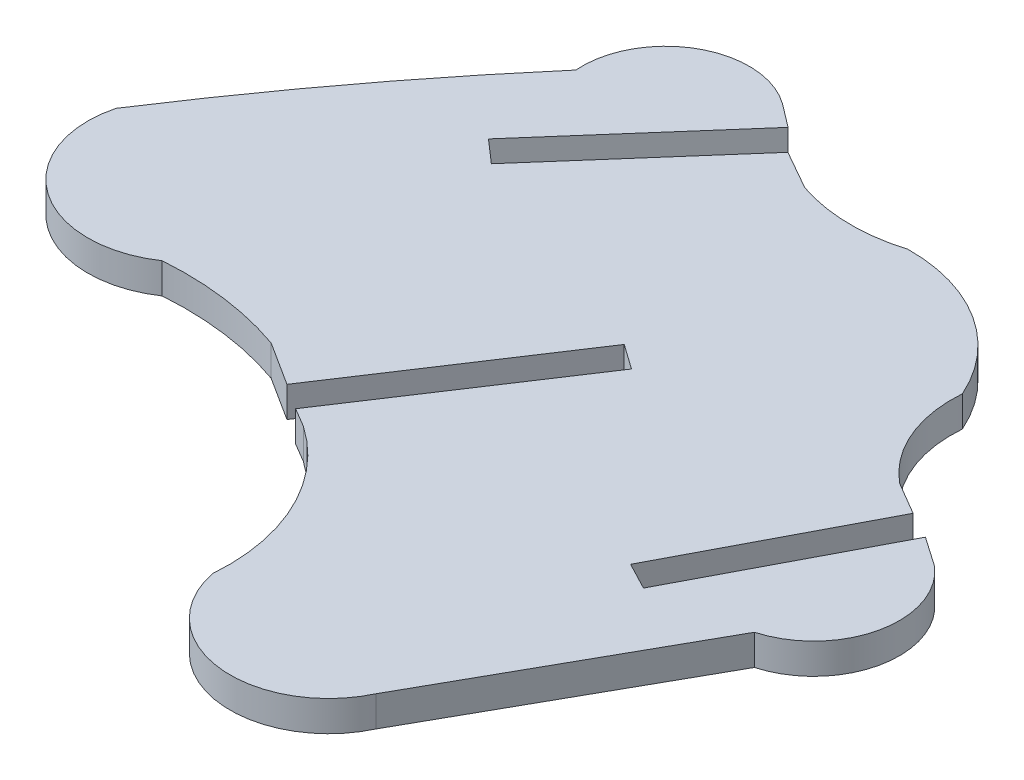
ISO-10303-21;
HEADER;
FILE_DESCRIPTION(('STEP AP214'),'2;1');
FILE_NAME('part.step','',(''),(''),'','','');
FILE_SCHEMA(('AUTOMOTIVE_DESIGN { 1 0 10303 214 1 1 1 1 }'));
ENDSEC;
DATA;
#1=APPLICATION_CONTEXT('core data for automotive mechanical design processes');
#2=APPLICATION_PROTOCOL_DEFINITION('international standard','automotive_design',2000,#1);
#3=PRODUCT_CONTEXT('',#1,'mechanical');
#4=PRODUCT('Part','Part','',(#3));
#5=PRODUCT_RELATED_PRODUCT_CATEGORY('part','',(#4));
#6=PRODUCT_DEFINITION_FORMATION('','',#4);
#7=PRODUCT_DEFINITION_CONTEXT('part definition',#1,'design');
#8=PRODUCT_DEFINITION('design','',#6,#7);
#9=PRODUCT_DEFINITION_SHAPE('','',#8);
#10=(LENGTH_UNIT() NAMED_UNIT(*) SI_UNIT(.MILLI.,.METRE.));
#11=(NAMED_UNIT(*) PLANE_ANGLE_UNIT() SI_UNIT($,.RADIAN.));
#12=(NAMED_UNIT(*) SI_UNIT($,.STERADIAN.) SOLID_ANGLE_UNIT());
#13=UNCERTAINTY_MEASURE_WITH_UNIT(LENGTH_MEASURE(1.E-05),#10,'distance_accuracy_value','');
#14=(GEOMETRIC_REPRESENTATION_CONTEXT(3) GLOBAL_UNCERTAINTY_ASSIGNED_CONTEXT((#13)) GLOBAL_UNIT_ASSIGNED_CONTEXT((#10,
#11,#12)) REPRESENTATION_CONTEXT('',''));
#15=CARTESIAN_POINT('',(0.,0.,0.));
#16=DIRECTION('',(0.,0.,1.));
#17=DIRECTION('',(1.,0.,0.));
#18=AXIS2_PLACEMENT_3D('',#15,#16,#17);
#19=CARTESIAN_POINT('',(-235.711884494084,2.,-510.480569438589));
#20=DIRECTION('',(0.,-1.,0.));
#21=DIRECTION('',(0.,0.,-1.));
#22=AXIS2_PLACEMENT_3D('',#19,#20,#21);
#23=CYLINDRICAL_SURFACE('',#22,12.5412215088);
#24=CARTESIAN_POINT('',(-235.711884494084,0.,-510.480569438589));
#25=DIRECTION('',(0.,1.,0.));
#26=DIRECTION('',(0.,0.,1.));
#27=AXIS2_PLACEMENT_3D('',#24,#25,#26);
#28=CIRCLE('',#27,12.5412215088);
#29=CARTESIAN_POINT('',(-223.211069999984,0.,-509.474650000015));
#30=VERTEX_POINT('',#29);
#31=CARTESIAN_POINT('',(-228.612580000002,0.,-520.818950000026));
#32=VERTEX_POINT('',#31);
#33=EDGE_CURVE('E11',#30,#32,#28,.T.);
#34=ORIENTED_EDGE('',*,*,#33,.F.);
#35=DIRECTION('',(0.,-1.,0.));
#36=VECTOR('',#35,1.);
#37=CARTESIAN_POINT('',(-223.211069999984,2.,-509.474650000015));
#38=LINE('',#37,#36);
#39=CARTESIAN_POINT('',(-223.211069999984,2.,-509.474650000015));
#40=VERTEX_POINT('',#39);
#41=EDGE_CURVE('E56',#40,#30,#38,.T.);
#42=ORIENTED_EDGE('',*,*,#41,.F.);
#43=CARTESIAN_POINT('',(-235.711884494084,2.,-510.480569438589));
#44=DIRECTION('',(0.,1.,0.));
#45=DIRECTION('',(0.,0.,1.));
#46=AXIS2_PLACEMENT_3D('',#43,#44,#45);
#47=CIRCLE('',#46,12.5412215088);
#48=CARTESIAN_POINT('',(-228.612580000002,2.,-520.818950000026));
#49=VERTEX_POINT('',#48);
#50=EDGE_CURVE('E41',#40,#49,#47,.T.);
#51=ORIENTED_EDGE('',*,*,#50,.T.);
#52=DIRECTION('',(0.,-1.,0.));
#53=VECTOR('',#52,1.);
#54=CARTESIAN_POINT('',(-228.612580000002,2.,-520.818950000026));
#55=LINE('',#54,#53);
#56=EDGE_CURVE('E148',#49,#32,#55,.T.);
#57=ORIENTED_EDGE('',*,*,#56,.T.);
#58=EDGE_LOOP('',(#34,#42,#51,#57));
#59=FACE_BOUND('',#58,.T.);
#60=ADVANCED_FACE('F37',(#59),#23,.F.);
#61=CARTESIAN_POINT('',(-216.882166172862,2.,-510.749570742108));
#62=DIRECTION('',(0.,-1.,0.));
#63=DIRECTION('',(0.,0.,-1.));
#64=AXIS2_PLACEMENT_3D('',#61,#62,#63);
#65=CYLINDRICAL_SURFACE('',#64,6.45603954073849);
#66=CARTESIAN_POINT('',(-216.882166172862,0.,-510.749570742108));
#67=DIRECTION('',(0.,1.,0.));
#68=DIRECTION('',(0.,0.,1.));
#69=AXIS2_PLACEMENT_3D('',#66,#67,#68);
#70=CIRCLE('',#69,6.45603954073849);
#71=CARTESIAN_POINT('',(-211.035769999997,0.,-508.010940000024));
#72=VERTEX_POINT('',#71);
#73=EDGE_CURVE('E47',#30,#72,#70,.T.);
#74=ORIENTED_EDGE('',*,*,#73,.T.);
#75=DIRECTION('',(0.,-1.,0.));
#76=VECTOR('',#75,1.);
#77=CARTESIAN_POINT('',(-211.035769999997,2.,-508.010940000024));
#78=LINE('',#77,#76);
#79=CARTESIAN_POINT('',(-211.035769999997,2.,-508.010940000024));
#80=VERTEX_POINT('',#79);
#81=EDGE_CURVE('E229',#80,#72,#78,.T.);
#82=ORIENTED_EDGE('',*,*,#81,.F.);
#83=CARTESIAN_POINT('',(-216.882166172862,2.,-510.749570742108));
#84=DIRECTION('',(0.,1.,0.));
#85=DIRECTION('',(0.,0.,1.));
#86=AXIS2_PLACEMENT_3D('',#83,#84,#85);
#87=CIRCLE('',#86,6.45603954073849);
#88=EDGE_CURVE('E139',#40,#80,#87,.T.);
#89=ORIENTED_EDGE('',*,*,#88,.F.);
#90=ORIENTED_EDGE('',*,*,#41,.T.);
#91=EDGE_LOOP('',(#74,#82,#89,#90));
#92=FACE_BOUND('',#91,.T.);
#93=ADVANCED_FACE('F515',(#92),#65,.T.);
#94=CARTESIAN_POINT('',(-258.966833597603,2.,-422.514085334196));
#95=DIRECTION('',(0.872276162813307,0.,0.48901359468597));
#96=DIRECTION('',(0.48901359468597,0.,-0.872276162813307));
#97=AXIS2_PLACEMENT_3D('',#94,#95,#96);
#98=PLANE('',#97);
#99=DIRECTION('',(-0.48901359468597,0.,0.872276162813307));
#100=VECTOR('',#99,1.);
#101=CARTESIAN_POINT('',(-258.966833597603,0.,-422.514085334196));
#102=LINE('',#101,#100);
#103=CARTESIAN_POINT('',(-202.129890000031,0.,-523.896769999974));
#104=VERTEX_POINT('',#103);
#105=EDGE_CURVE('E234',#104,#72,#102,.T.);
#106=ORIENTED_EDGE('',*,*,#105,.F.);
#107=DIRECTION('',(0.,-1.,0.));
#108=VECTOR('',#107,1.);
#109=CARTESIAN_POINT('',(-202.129890000031,2.,-523.896769999974));
#110=LINE('',#109,#108);
#111=CARTESIAN_POINT('',(-202.129890000031,2.,-523.896769999974));
#112=VERTEX_POINT('',#111);
#113=EDGE_CURVE('E218',#112,#104,#110,.T.);
#114=ORIENTED_EDGE('',*,*,#113,.F.);
#115=DIRECTION('',(-0.48901359468597,0.,0.872276162813307));
#116=VECTOR('',#115,1.);
#117=CARTESIAN_POINT('',(-258.966833597603,2.,-422.514085334196));
#118=LINE('',#117,#116);
#119=EDGE_CURVE('E307',#112,#80,#118,.T.);
#120=ORIENTED_EDGE('',*,*,#119,.T.);
#121=ORIENTED_EDGE('',*,*,#81,.T.);
#122=EDGE_LOOP('',(#106,#114,#120,#121));
#123=FACE_BOUND('',#122,.T.);
#124=ADVANCED_FACE('F239',(#123),#98,.T.);
#125=CARTESIAN_POINT('',(-203.653200815397,2.,-529.303776380724));
#126=DIRECTION('',(0.,-1.,0.));
#127=DIRECTION('',(0.,0.,-1.));
#128=AXIS2_PLACEMENT_3D('',#125,#126,#127);
#129=CYLINDRICAL_SURFACE('',#128,5.61748999479998);
#130=CARTESIAN_POINT('',(-203.653200815397,0.,-529.303776380724));
#131=DIRECTION('',(0.,1.,0.));
#132=DIRECTION('',(0.,0.,1.));
#133=AXIS2_PLACEMENT_3D('',#130,#131,#132);
#134=CIRCLE('',#133,5.61748999479998);
#135=CARTESIAN_POINT('',(-199.958510000014,0.,-533.535260000024));
#136=VERTEX_POINT('',#135);
#137=EDGE_CURVE('E222',#104,#136,#134,.T.);
#138=ORIENTED_EDGE('',*,*,#137,.T.);
#139=DIRECTION('',(0.,-1.,0.));
#140=VECTOR('',#139,1.);
#141=CARTESIAN_POINT('',(-199.958510000014,2.,-533.535260000024));
#142=LINE('',#141,#140);
#143=CARTESIAN_POINT('',(-199.958510000014,2.,-533.535260000024));
#144=VERTEX_POINT('',#143);
#145=EDGE_CURVE('E228',#144,#136,#142,.T.);
#146=ORIENTED_EDGE('',*,*,#145,.F.);
#147=CARTESIAN_POINT('',(-203.653200815397,2.,-529.303776380724));
#148=DIRECTION('',(0.,1.,0.));
#149=DIRECTION('',(0.,0.,1.));
#150=AXIS2_PLACEMENT_3D('',#147,#148,#149);
#151=CIRCLE('',#150,5.61748999479998);
#152=EDGE_CURVE('E224',#112,#144,#151,.T.);
#153=ORIENTED_EDGE('',*,*,#152,.F.);
#154=ORIENTED_EDGE('',*,*,#113,.T.);
#155=EDGE_LOOP('',(#138,#146,#153,#154));
#156=FACE_BOUND('',#155,.T.);
#157=ADVANCED_FACE('F220',(#156),#129,.T.);
#158=CARTESIAN_POINT('',(-438.098001077453,2.,-698.698006578554));
#159=DIRECTION('',(0.569902422657265,0.,-0.821712375864804));
#160=DIRECTION('',(-0.821712375864804,0.,-0.569902422657265));
#161=AXIS2_PLACEMENT_3D('',#158,#159,#160);
#162=PLANE('',#161);
#163=DIRECTION('',(0.821712375864804,0.,0.569902422657265));
#164=VECTOR('',#163,1.);
#165=CARTESIAN_POINT('',(-438.098001077453,0.,-698.698006578554));
#166=LINE('',#165,#164);
#167=CARTESIAN_POINT('',(-201.922089999997,0.,-534.897110000024));
#168=VERTEX_POINT('',#167);
#169=EDGE_CURVE('E237',#168,#136,#166,.T.);
#170=ORIENTED_EDGE('',*,*,#169,.F.);
#171=DIRECTION('',(0.,-1.,0.));
#172=VECTOR('',#171,1.);
#173=CARTESIAN_POINT('',(-201.922089999997,2.,-534.897110000024));
#174=LINE('',#173,#172);
#175=CARTESIAN_POINT('',(-201.922089999997,2.,-534.897110000024));
#176=VERTEX_POINT('',#175);
#177=EDGE_CURVE('E378',#176,#168,#174,.T.);
#178=ORIENTED_EDGE('',*,*,#177,.F.);
#179=DIRECTION('',(0.821712375864804,0.,0.569902422657265));
#180=VECTOR('',#179,1.);
#181=CARTESIAN_POINT('',(-438.098001077453,2.,-698.698006578554));
#182=LINE('',#181,#180);
#183=EDGE_CURVE('E303',#176,#144,#182,.T.);
#184=ORIENTED_EDGE('',*,*,#183,.T.);
#185=ORIENTED_EDGE('',*,*,#145,.T.);
#186=EDGE_LOOP('',(#170,#178,#184,#185));
#187=FACE_BOUND('',#186,.T.);
#188=ADVANCED_FACE('F382',(#187),#162,.T.);
#189=CARTESIAN_POINT('',(-256.288373174879,2.,-431.034207783274));
#190=DIRECTION('',(-0.885965062883389,0.,-0.463751989052373));
#191=DIRECTION('',(-0.463751989052373,0.,0.885965062883389));
#192=AXIS2_PLACEMENT_3D('',#189,#190,#191);
#193=PLANE('',#192);
#194=DIRECTION('',(0.463751989052373,0.,-0.885965062883389));
#195=VECTOR('',#194,1.);
#196=CARTESIAN_POINT('',(-256.288373174879,0.,-431.034207783274));
#197=LINE('',#196,#195);
#198=CARTESIAN_POINT('',(-208.270209999978,0.,-522.769480000061));
#199=VERTEX_POINT('',#198);
#200=EDGE_CURVE('E371',#199,#168,#197,.T.);
#201=ORIENTED_EDGE('',*,*,#200,.F.);
#202=DIRECTION('',(0.,-1.,0.));
#203=VECTOR('',#202,1.);
#204=CARTESIAN_POINT('',(-208.270209999978,2.,-522.769480000061));
#205=LINE('',#204,#203);
#206=CARTESIAN_POINT('',(-208.270209999978,2.,-522.769480000061));
#207=VERTEX_POINT('',#206);
#208=EDGE_CURVE('E376',#207,#199,#205,.T.);
#209=ORIENTED_EDGE('',*,*,#208,.F.);
#210=DIRECTION('',(0.463751989052373,0.,-0.885965062883389));
#211=VECTOR('',#210,1.);
#212=CARTESIAN_POINT('',(-256.288373174879,2.,-431.034207783274));
#213=LINE('',#212,#211);
#214=EDGE_CURVE('E300',#207,#176,#213,.T.);
#215=ORIENTED_EDGE('',*,*,#214,.T.);
#216=ORIENTED_EDGE('',*,*,#177,.T.);
#217=EDGE_LOOP('',(#201,#209,#215,#216));
#218=FACE_BOUND('',#217,.T.);
#219=ADVANCED_FACE('F375',(#218),#193,.T.);
#220=CARTESIAN_POINT('',(-477.85091102508,2.,-663.880469716249));
#221=DIRECTION('',(0.463754378279722,0.,-0.88596381225555));
#222=DIRECTION('',(-0.885963812255551,0.,-0.463754378279723));
#223=AXIS2_PLACEMENT_3D('',#220,#221,#222);
#224=PLANE('',#223);
#225=DIRECTION('',(0.88596381225555,0.,0.463754378279723));
#226=VECTOR('',#225,1.);
#227=CARTESIAN_POINT('',(-477.85091102508,0.,-663.880469716249));
#228=LINE('',#227,#226);
#229=CARTESIAN_POINT('',(-210.042139999965,0.,-523.696990000054));
#230=VERTEX_POINT('',#229);
#231=EDGE_CURVE('E368',#230,#199,#228,.T.);
#232=ORIENTED_EDGE('',*,*,#231,.F.);
#233=DIRECTION('',(0.,-1.,0.));
#234=VECTOR('',#233,1.);
#235=CARTESIAN_POINT('',(-210.042139999965,2.,-523.696990000054));
#236=LINE('',#235,#234);
#237=CARTESIAN_POINT('',(-210.042139999965,2.,-523.696990000054));
#238=VERTEX_POINT('',#237);
#239=EDGE_CURVE('E387',#238,#230,#236,.T.);
#240=ORIENTED_EDGE('',*,*,#239,.F.);
#241=DIRECTION('',(0.88596381225555,0.,0.463754378279723));
#242=VECTOR('',#241,1.);
#243=CARTESIAN_POINT('',(-477.85091102508,2.,-663.880469716249));
#244=LINE('',#243,#242);
#245=EDGE_CURVE('E297',#238,#207,#244,.T.);
#246=ORIENTED_EDGE('',*,*,#245,.T.);
#247=ORIENTED_EDGE('',*,*,#208,.T.);
#248=EDGE_LOOP('',(#232,#240,#246,#247));
#249=FACE_BOUND('',#248,.T.);
#250=ADVANCED_FACE('F504',(#249),#224,.T.);
#251=CARTESIAN_POINT('',(-258.060317912599,2.,-431.961701408165));
#252=DIRECTION('',(0.885965038414878,0.,0.463752035797714));
#253=DIRECTION('',(0.463752035797714,0.,-0.885965038414878));
#254=AXIS2_PLACEMENT_3D('',#251,#252,#253);
#255=PLANE('',#254);
#256=DIRECTION('',(-0.463752035797714,0.,0.885965038414878));
#257=VECTOR('',#256,1.);
#258=CARTESIAN_POINT('',(-258.060317912599,0.,-431.961701408165));
#259=LINE('',#258,#257);
#260=CARTESIAN_POINT('',(-203.681979999965,0.,-535.847620000054));
#261=VERTEX_POINT('',#260);
#262=EDGE_CURVE('E365',#261,#230,#259,.T.);
#263=ORIENTED_EDGE('',*,*,#262,.F.);
#264=DIRECTION('',(0.,-1.,0.));
#265=VECTOR('',#264,1.);
#266=CARTESIAN_POINT('',(-203.681979999965,2.,-535.847620000054));
#267=LINE('',#266,#265);
#268=CARTESIAN_POINT('',(-203.681979999965,2.,-535.847620000054));
#269=VERTEX_POINT('',#268);
#270=EDGE_CURVE('E389',#269,#261,#267,.T.);
#271=ORIENTED_EDGE('',*,*,#270,.F.);
#272=DIRECTION('',(-0.463752035797714,0.,0.885965038414878));
#273=VECTOR('',#272,1.);
#274=CARTESIAN_POINT('',(-258.060317912599,2.,-431.961701408165));
#275=LINE('',#274,#273);
#276=EDGE_CURVE('E294',#269,#238,#275,.T.);
#277=ORIENTED_EDGE('',*,*,#276,.T.);
#278=ORIENTED_EDGE('',*,*,#239,.T.);
#279=EDGE_LOOP('',(#263,#271,#277,#278));
#280=FACE_BOUND('',#279,.T.);
#281=ADVANCED_FACE('F501',(#280),#255,.T.);
#282=CARTESIAN_POINT('',(-458.970400875631,2.,-685.935431901808));
#283=DIRECTION('',(0.506814779924682,0.,-0.862054974378024));
#284=DIRECTION('',(-0.862054974378024,0.,-0.506814779924682));
#285=AXIS2_PLACEMENT_3D('',#282,#283,#284);
#286=PLANE('',#285);
#287=DIRECTION('',(0.862054974378024,0.,0.506814779924682));
#288=VECTOR('',#287,1.);
#289=CARTESIAN_POINT('',(-458.970400875631,0.,-685.935431901808));
#290=LINE('',#289,#288);
#291=CARTESIAN_POINT('',(-205.817629999944,0.,-537.103200000061));
#292=VERTEX_POINT('',#291);
#293=EDGE_CURVE('E362',#292,#261,#290,.T.);
#294=ORIENTED_EDGE('',*,*,#293,.F.);
#295=DIRECTION('',(0.,-1.,0.));
#296=VECTOR('',#295,1.);
#297=CARTESIAN_POINT('',(-205.817629999944,2.,-537.103200000061));
#298=LINE('',#297,#296);
#299=CARTESIAN_POINT('',(-205.817629999944,2.,-537.103200000061));
#300=VERTEX_POINT('',#299);
#301=EDGE_CURVE('E391',#300,#292,#298,.T.);
#302=ORIENTED_EDGE('',*,*,#301,.F.);
#303=DIRECTION('',(0.862054974378024,0.,0.506814779924682));
#304=VECTOR('',#303,1.);
#305=CARTESIAN_POINT('',(-458.970400875631,2.,-685.935431901808));
#306=LINE('',#305,#304);
#307=EDGE_CURVE('E291',#300,#269,#306,.T.);
#308=ORIENTED_EDGE('',*,*,#307,.T.);
#309=ORIENTED_EDGE('',*,*,#270,.T.);
#310=EDGE_LOOP('',(#294,#302,#308,#309));
#311=FACE_BOUND('',#310,.T.);
#312=ADVANCED_FACE('F497',(#311),#286,.T.);
#313=CARTESIAN_POINT('',(-200.512400828708,2.,-543.566721953589));
#314=DIRECTION('',(0.,-1.,0.));
#315=DIRECTION('',(0.,0.,-1.));
#316=AXIS2_PLACEMENT_3D('',#313,#314,#315);
#317=CYLINDRICAL_SURFACE('',#316,8.36197181309996);
#318=CARTESIAN_POINT('',(-200.512400828708,0.,-543.566721953589));
#319=DIRECTION('',(0.,1.,0.));
#320=DIRECTION('',(0.,0.,1.));
#321=AXIS2_PLACEMENT_3D('',#318,#319,#320);
#322=CIRCLE('',#321,8.36197181309996);
#323=CARTESIAN_POINT('',(-208.846909999995,0.,-544.243870000035));
#324=VERTEX_POINT('',#323);
#325=EDGE_CURVE('E359',#324,#292,#322,.T.);
#326=ORIENTED_EDGE('',*,*,#325,.F.);
#327=DIRECTION('',(0.,-1.,0.));
#328=VECTOR('',#327,1.);
#329=CARTESIAN_POINT('',(-208.846909999995,2.,-544.243870000035));
#330=LINE('',#329,#328);
#331=CARTESIAN_POINT('',(-208.846909999995,2.,-544.243870000035));
#332=VERTEX_POINT('',#331);
#333=EDGE_CURVE('E393',#332,#324,#330,.T.);
#334=ORIENTED_EDGE('',*,*,#333,.F.);
#335=CARTESIAN_POINT('',(-200.512400828708,2.,-543.566721953589));
#336=DIRECTION('',(0.,1.,0.));
#337=DIRECTION('',(0.,0.,1.));
#338=AXIS2_PLACEMENT_3D('',#335,#336,#337);
#339=CIRCLE('',#338,8.36197181309996);
#340=EDGE_CURVE('E288',#332,#300,#339,.T.);
#341=ORIENTED_EDGE('',*,*,#340,.T.);
#342=ORIENTED_EDGE('',*,*,#301,.T.);
#343=EDGE_LOOP('',(#326,#334,#341,#342));
#344=FACE_BOUND('',#343,.T.);
#345=ADVANCED_FACE('F493',(#344),#317,.F.);
#346=CARTESIAN_POINT('',(-218.7033987411,2.,-539.884979190239));
#347=DIRECTION('',(0.,-1.,0.));
#348=DIRECTION('',(0.,0.,-1.));
#349=AXIS2_PLACEMENT_3D('',#346,#347,#348);
#350=CYLINDRICAL_SURFACE('',#349,10.7773048298384);
#351=CARTESIAN_POINT('',(-218.7033987411,0.,-539.884979190239));
#352=DIRECTION('',(0.,1.,0.));
#353=DIRECTION('',(0.,0.,1.));
#354=AXIS2_PLACEMENT_3D('',#351,#352,#353);
#355=CIRCLE('',#354,10.7773048298384);
#356=CARTESIAN_POINT('',(-218.823929999986,0.,-550.661610000046));
#357=VERTEX_POINT('',#356);
#358=EDGE_CURVE('E356',#324,#357,#355,.T.);
#359=ORIENTED_EDGE('',*,*,#358,.T.);
#360=DIRECTION('',(0.,-1.,0.));
#361=VECTOR('',#360,1.);
#362=CARTESIAN_POINT('',(-218.823929999986,2.,-550.661610000046));
#363=LINE('',#362,#361);
#364=CARTESIAN_POINT('',(-218.823929999986,2.,-550.661610000046));
#365=VERTEX_POINT('',#364);
#366=EDGE_CURVE('E395',#365,#357,#363,.T.);
#367=ORIENTED_EDGE('',*,*,#366,.F.);
#368=CARTESIAN_POINT('',(-218.7033987411,2.,-539.884979190239));
#369=DIRECTION('',(0.,1.,0.));
#370=DIRECTION('',(0.,0.,1.));
#371=AXIS2_PLACEMENT_3D('',#368,#369,#370);
#372=CIRCLE('',#371,10.7773048298384);
#373=EDGE_CURVE('E286',#332,#365,#372,.T.);
#374=ORIENTED_EDGE('',*,*,#373,.F.);
#375=ORIENTED_EDGE('',*,*,#333,.T.);
#376=EDGE_LOOP('',(#359,#367,#374,#375));
#377=FACE_BOUND('',#376,.T.);
#378=ADVANCED_FACE('F490',(#377),#350,.T.);
#379=CARTESIAN_POINT('',(-222.085309382089,2.,-561.436569989673));
#380=DIRECTION('',(0.,-1.,0.));
#381=DIRECTION('',(0.,0.,-1.));
#382=AXIS2_PLACEMENT_3D('',#379,#380,#381);
#383=CYLINDRICAL_SURFACE('',#382,11.2577243815999);
#384=CARTESIAN_POINT('',(-222.085309382089,0.,-561.436569989673));
#385=DIRECTION('',(0.,1.,0.));
#386=DIRECTION('',(0.,0.,1.));
#387=AXIS2_PLACEMENT_3D('',#384,#385,#386);
#388=CIRCLE('',#387,11.2577243815999);
#389=CARTESIAN_POINT('',(-225.70407,0.,-550.77632));
#390=VERTEX_POINT('',#389);
#391=EDGE_CURVE('E353',#390,#357,#388,.T.);
#392=ORIENTED_EDGE('',*,*,#391,.F.);
#393=DIRECTION('',(0.,-1.,0.));
#394=VECTOR('',#393,1.);
#395=CARTESIAN_POINT('',(-225.70407,2.,-550.77632));
#396=LINE('',#395,#394);
#397=CARTESIAN_POINT('',(-225.70407,2.,-550.77632));
#398=VERTEX_POINT('',#397);
#399=EDGE_CURVE('E397',#398,#390,#396,.T.);
#400=ORIENTED_EDGE('',*,*,#399,.F.);
#401=CARTESIAN_POINT('',(-222.085309382089,2.,-561.436569989673));
#402=DIRECTION('',(0.,1.,0.));
#403=DIRECTION('',(0.,0.,1.));
#404=AXIS2_PLACEMENT_3D('',#401,#402,#403);
#405=CIRCLE('',#404,11.2577243815999);
#406=EDGE_CURVE('E283',#398,#365,#405,.T.);
#407=ORIENTED_EDGE('',*,*,#406,.T.);
#408=ORIENTED_EDGE('',*,*,#366,.T.);
#409=EDGE_LOOP('',(#392,#400,#407,#408));
#410=FACE_BOUND('',#409,.T.);
#411=ADVANCED_FACE('F485',(#410),#383,.F.);
#412=CARTESIAN_POINT('',(-462.078113074732,2.,-684.719644917093));
#413=DIRECTION('',(0.493007094106514,0.,-0.870025289954637));
#414=DIRECTION('',(-0.870025289954637,0.,-0.493007094106514));
#415=AXIS2_PLACEMENT_3D('',#412,#413,#414);
#416=PLANE('',#415);
#417=DIRECTION('',(0.870025289954637,0.,0.493007094106514));
#418=VECTOR('',#417,1.);
#419=CARTESIAN_POINT('',(-462.078113074732,0.,-684.719644917093));
#420=LINE('',#419,#418);
#421=CARTESIAN_POINT('',(-228.26879,0.,-552.22964));
#422=VERTEX_POINT('',#421);
#423=EDGE_CURVE('E350',#422,#390,#420,.T.);
#424=ORIENTED_EDGE('',*,*,#423,.F.);
#425=DIRECTION('',(0.,-1.,0.));
#426=VECTOR('',#425,1.);
#427=CARTESIAN_POINT('',(-228.26879,2.,-552.22964));
#428=LINE('',#427,#426);
#429=CARTESIAN_POINT('',(-228.26879,2.,-552.22964));
#430=VERTEX_POINT('',#429);
#431=EDGE_CURVE('E399',#430,#422,#428,.T.);
#432=ORIENTED_EDGE('',*,*,#431,.F.);
#433=DIRECTION('',(0.870025289954637,0.,0.493007094106514));
#434=VECTOR('',#433,1.);
#435=CARTESIAN_POINT('',(-462.078113074732,2.,-684.719644917093));
#436=LINE('',#435,#434);
#437=EDGE_CURVE('E280',#430,#398,#436,.T.);
#438=ORIENTED_EDGE('',*,*,#437,.T.);
#439=ORIENTED_EDGE('',*,*,#399,.T.);
#440=EDGE_LOOP('',(#424,#432,#438,#439));
#441=FACE_BOUND('',#440,.T.);
#442=ADVANCED_FACE('F480',(#441),#416,.T.);
#443=CARTESIAN_POINT('',(-347.411468095468,2.,-416.032601291625));
#444=DIRECTION('',(-0.752658111726318,0.,-0.658411548237555));
#445=DIRECTION('',(-0.658411548237555,0.,0.752658111726318));
#446=AXIS2_PLACEMENT_3D('',#443,#444,#445);
#447=PLANE('',#446);
#448=DIRECTION('',(0.658411548237555,0.,-0.752658111726318));
#449=VECTOR('',#448,1.);
#450=CARTESIAN_POINT('',(-347.411468095468,0.,-416.032601291625));
#451=LINE('',#450,#449);
#452=CARTESIAN_POINT('',(-237.3355,0.,-541.8651));
#453=VERTEX_POINT('',#452);
#454=EDGE_CURVE('E347',#453,#422,#451,.T.);
#455=ORIENTED_EDGE('',*,*,#454,.F.);
#456=DIRECTION('',(0.,-1.,0.));
#457=VECTOR('',#456,1.);
#458=CARTESIAN_POINT('',(-237.3355,2.,-541.8651));
#459=LINE('',#458,#457);
#460=CARTESIAN_POINT('',(-237.3355,2.,-541.8651));
#461=VERTEX_POINT('',#460);
#462=EDGE_CURVE('E401',#461,#453,#459,.T.);
#463=ORIENTED_EDGE('',*,*,#462,.F.);
#464=DIRECTION('',(0.658411548237555,0.,-0.752658111726318));
#465=VECTOR('',#464,1.);
#466=CARTESIAN_POINT('',(-347.411468095468,2.,-416.032601291625));
#467=LINE('',#466,#465);
#468=EDGE_CURVE('E277',#461,#430,#467,.T.);
#469=ORIENTED_EDGE('',*,*,#468,.T.);
#470=ORIENTED_EDGE('',*,*,#431,.T.);
#471=EDGE_LOOP('',(#455,#463,#469,#470));
#472=FACE_BOUND('',#471,.T.);
#473=ADVANCED_FACE('F476',(#472),#447,.T.);
#474=CARTESIAN_POINT('',(-415.794413111484,2.,-697.976934004373));
#475=DIRECTION('',(0.658409735418099,0.,-0.752659697543763));
#476=DIRECTION('',(-0.752659697543763,0.,-0.658409735418099));
#477=AXIS2_PLACEMENT_3D('',#474,#475,#476);
#478=PLANE('',#477);
#479=DIRECTION('',(0.752659697543763,0.,0.658409735418099));
#480=VECTOR('',#479,1.);
#481=CARTESIAN_POINT('',(-415.794413111484,0.,-697.976934004373));
#482=LINE('',#481,#480);
#483=CARTESIAN_POINT('',(-238.84082,0.,-543.18192));
#484=VERTEX_POINT('',#483);
#485=EDGE_CURVE('E344',#484,#453,#482,.T.);
#486=ORIENTED_EDGE('',*,*,#485,.F.);
#487=DIRECTION('',(0.,-1.,0.));
#488=VECTOR('',#487,1.);
#489=CARTESIAN_POINT('',(-238.84082,2.,-543.18192));
#490=LINE('',#489,#488);
#491=CARTESIAN_POINT('',(-238.84082,2.,-543.18192));
#492=VERTEX_POINT('',#491);
#493=EDGE_CURVE('E403',#492,#484,#490,.T.);
#494=ORIENTED_EDGE('',*,*,#493,.F.);
#495=DIRECTION('',(0.752659697543763,0.,0.658409735418099));
#496=VECTOR('',#495,1.);
#497=CARTESIAN_POINT('',(-415.794413111484,2.,-697.976934004373));
#498=LINE('',#497,#496);
#499=EDGE_CURVE('E274',#492,#461,#498,.T.);
#500=ORIENTED_EDGE('',*,*,#499,.T.);
#501=ORIENTED_EDGE('',*,*,#462,.T.);
#502=EDGE_LOOP('',(#486,#494,#500,#501));
#503=FACE_BOUND('',#502,.T.);
#504=ADVANCED_FACE('F472',(#503),#478,.T.);
#505=CARTESIAN_POINT('',(-348.916762107246,2.,-417.34943035473));
#506=DIRECTION('',(0.752658165258814,0.,0.658411487042287));
#507=DIRECTION('',(0.658411487042287,0.,-0.752658165258814));
#508=AXIS2_PLACEMENT_3D('',#505,#506,#507);
#509=PLANE('',#508);
#510=DIRECTION('',(-0.658411487042287,0.,0.752658165258814));
#511=VECTOR('',#510,1.);
#512=CARTESIAN_POINT('',(-348.916762107246,0.,-417.34943035473));
#513=LINE('',#512,#511);
#514=CARTESIAN_POINT('',(-229.67995,0.,-553.6541));
#515=VERTEX_POINT('',#514);
#516=EDGE_CURVE('E341',#515,#484,#513,.T.);
#517=ORIENTED_EDGE('',*,*,#516,.F.);
#518=DIRECTION('',(0.,-1.,0.));
#519=VECTOR('',#518,1.);
#520=CARTESIAN_POINT('',(-229.67995,2.,-553.6541));
#521=LINE('',#520,#519);
#522=CARTESIAN_POINT('',(-229.67995,2.,-553.6541));
#523=VERTEX_POINT('',#522);
#524=EDGE_CURVE('E405',#523,#515,#521,.T.);
#525=ORIENTED_EDGE('',*,*,#524,.F.);
#526=DIRECTION('',(-0.658411487042287,0.,0.752658165258814));
#527=VECTOR('',#526,1.);
#528=CARTESIAN_POINT('',(-348.916762107246,2.,-417.34943035473));
#529=LINE('',#528,#527);
#530=EDGE_CURVE('E271',#523,#492,#529,.T.);
#531=ORIENTED_EDGE('',*,*,#530,.T.);
#532=ORIENTED_EDGE('',*,*,#493,.T.);
#533=EDGE_LOOP('',(#517,#525,#531,#532));
#534=FACE_BOUND('',#533,.T.);
#535=ADVANCED_FACE('F468',(#534),#509,.T.);
#536=CARTESIAN_POINT('',(-426.558790546682,2.,-703.033898821824));
#537=DIRECTION('',(0.604446673035155,0.,-0.796645604680483));
#538=DIRECTION('',(-0.796645604680483,0.,-0.604446673035155));
#539=AXIS2_PLACEMENT_3D('',#536,#537,#538);
#540=PLANE('',#539);
#541=DIRECTION('',(0.796645604680483,0.,0.604446673035155));
#542=VECTOR('',#541,1.);
#543=CARTESIAN_POINT('',(-426.558790546682,0.,-703.033898821824));
#544=LINE('',#543,#542);
#545=CARTESIAN_POINT('',(-231.192010000025,0.,-554.801360000024));
#546=VERTEX_POINT('',#545);
#547=EDGE_CURVE('E338',#546,#515,#544,.T.);
#548=ORIENTED_EDGE('',*,*,#547,.F.);
#549=DIRECTION('',(0.,-1.,0.));
#550=VECTOR('',#549,1.);
#551=CARTESIAN_POINT('',(-231.192010000025,2.,-554.801360000024));
#552=LINE('',#551,#550);
#553=CARTESIAN_POINT('',(-231.192010000025,2.,-554.801360000024));
#554=VERTEX_POINT('',#553);
#555=EDGE_CURVE('E407',#554,#546,#552,.T.);
#556=ORIENTED_EDGE('',*,*,#555,.F.);
#557=DIRECTION('',(0.796645604680483,0.,0.604446673035155));
#558=VECTOR('',#557,1.);
#559=CARTESIAN_POINT('',(-426.558790546682,2.,-703.033898821824));
#560=LINE('',#559,#558);
#561=EDGE_CURVE('E268',#554,#523,#560,.T.);
#562=ORIENTED_EDGE('',*,*,#561,.T.);
#563=ORIENTED_EDGE('',*,*,#524,.T.);
#564=EDGE_LOOP('',(#548,#556,#562,#563));
#565=FACE_BOUND('',#564,.T.);
#566=ADVANCED_FACE('F462',(#565),#540,.T.);
#567=CARTESIAN_POINT('',(-234.420539867,2.,-550.3684700742));
#568=DIRECTION('',(0.,-1.,0.));
#569=DIRECTION('',(0.,0.,-1.));
#570=AXIS2_PLACEMENT_3D('',#567,#568,#569);
#571=CYLINDRICAL_SURFACE('',#570,5.48396920089999);
#572=CARTESIAN_POINT('',(-234.420539867,0.,-550.3684700742));
#573=DIRECTION('',(0.,1.,0.));
#574=DIRECTION('',(0.,0.,1.));
#575=AXIS2_PLACEMENT_3D('',#572,#573,#574);
#576=CIRCLE('',#575,5.48396920089999);
#577=CARTESIAN_POINT('',(-239.888730000002,0.,-549.952760000043));
#578=VERTEX_POINT('',#577);
#579=EDGE_CURVE('E336',#546,#578,#576,.T.);
#580=ORIENTED_EDGE('',*,*,#579,.T.);
#581=DIRECTION('',(0.,-1.,0.));
#582=VECTOR('',#581,1.);
#583=CARTESIAN_POINT('',(-239.888730000002,2.,-549.952760000043));
#584=LINE('',#583,#582);
#585=CARTESIAN_POINT('',(-239.888730000002,2.,-549.952760000043));
#586=VERTEX_POINT('',#585);
#587=EDGE_CURVE('E409',#586,#578,#584,.T.);
#588=ORIENTED_EDGE('',*,*,#587,.F.);
#589=CARTESIAN_POINT('',(-234.420539867,2.,-550.3684700742));
#590=DIRECTION('',(0.,1.,0.));
#591=DIRECTION('',(0.,0.,1.));
#592=AXIS2_PLACEMENT_3D('',#589,#590,#591);
#593=CIRCLE('',#592,5.48396920089999);
#594=EDGE_CURVE('E266',#554,#586,#593,.T.);
#595=ORIENTED_EDGE('',*,*,#594,.F.);
#596=ORIENTED_EDGE('',*,*,#555,.T.);
#597=EDGE_LOOP('',(#580,#588,#595,#596));
#598=FACE_BOUND('',#597,.T.);
#599=ADVANCED_FACE('F505',(#598),#571,.T.);
#600=CARTESIAN_POINT('',(-115.989651169554,2.,-443.867928435971));
#601=DIRECTION('',(0.,-1.,0.));
#602=DIRECTION('',(0.,0.,-1.));
#603=AXIS2_PLACEMENT_3D('',#600,#601,#602);
#604=CYLINDRICAL_SURFACE('',#603,163.1103099838);
#605=CARTESIAN_POINT('',(-115.989651169554,0.,-443.867928435971));
#606=DIRECTION('',(0.,1.,0.));
#607=DIRECTION('',(0.,0.,1.));
#608=AXIS2_PLACEMENT_3D('',#605,#606,#607);
#609=CIRCLE('',#608,163.1103099838);
#610=CARTESIAN_POINT('',(-252.780349999994,0.,-532.712050000042));
#611=VERTEX_POINT('',#610);
#612=EDGE_CURVE('E334',#578,#611,#609,.T.);
#613=ORIENTED_EDGE('',*,*,#612,.T.);
#614=DIRECTION('',(0.,-1.,0.));
#615=VECTOR('',#614,1.);
#616=CARTESIAN_POINT('',(-252.780349999994,2.,-532.712050000042));
#617=LINE('',#616,#615);
#618=CARTESIAN_POINT('',(-252.780349999994,2.,-532.712050000042));
#619=VERTEX_POINT('',#618);
#620=EDGE_CURVE('E412',#619,#611,#617,.T.);
#621=ORIENTED_EDGE('',*,*,#620,.F.);
#622=CARTESIAN_POINT('',(-115.989651169554,2.,-443.867928435971));
#623=DIRECTION('',(0.,1.,0.));
#624=DIRECTION('',(0.,0.,1.));
#625=AXIS2_PLACEMENT_3D('',#622,#623,#624);
#626=CIRCLE('',#625,163.1103099838);
#627=EDGE_CURVE('E264',#586,#619,#626,.T.);
#628=ORIENTED_EDGE('',*,*,#627,.F.);
#629=ORIENTED_EDGE('',*,*,#587,.T.);
#630=EDGE_LOOP('',(#613,#621,#628,#629));
#631=FACE_BOUND('',#630,.T.);
#632=ADVANCED_FACE('F456',(#631),#604,.T.);
#633=CARTESIAN_POINT('',(-246.347787243296,2.,-531.069108064103));
#634=DIRECTION('',(0.,-1.,0.));
#635=DIRECTION('',(0.,0.,-1.));
#636=AXIS2_PLACEMENT_3D('',#633,#634,#635);
#637=CYLINDRICAL_SURFACE('',#636,6.63906031180155);
#638=CARTESIAN_POINT('',(-246.347787243296,0.,-531.069108064103));
#639=DIRECTION('',(0.,1.,0.));
#640=DIRECTION('',(0.,0.,1.));
#641=AXIS2_PLACEMENT_3D('',#638,#639,#640);
#642=CIRCLE('',#641,6.63906031180155);
#643=CARTESIAN_POINT('',(-242.618849999993,0.,-525.57618999997));
#644=VERTEX_POINT('',#643);
#645=EDGE_CURVE('E331',#611,#644,#642,.T.);
#646=ORIENTED_EDGE('',*,*,#645,.T.);
#647=DIRECTION('',(0.,-1.,0.));
#648=VECTOR('',#647,1.);
#649=CARTESIAN_POINT('',(-242.618849999993,2.,-525.57618999997));
#650=LINE('',#649,#648);
#651=CARTESIAN_POINT('',(-242.618849999993,2.,-525.57618999997));
#652=VERTEX_POINT('',#651);
#653=EDGE_CURVE('E415',#652,#644,#650,.T.);
#654=ORIENTED_EDGE('',*,*,#653,.F.);
#655=CARTESIAN_POINT('',(-246.347787243296,2.,-531.069108064103));
#656=DIRECTION('',(0.,1.,0.));
#657=DIRECTION('',(0.,0.,1.));
#658=AXIS2_PLACEMENT_3D('',#655,#656,#657);
#659=CIRCLE('',#658,6.63906031180155);
#660=EDGE_CURVE('E262',#619,#652,#659,.T.);
#661=ORIENTED_EDGE('',*,*,#660,.F.);
#662=ORIENTED_EDGE('',*,*,#620,.T.);
#663=EDGE_LOOP('',(#646,#654,#661,#662));
#664=FACE_BOUND('',#663,.T.);
#665=ADVANCED_FACE('F452',(#664),#637,.T.);
#666=CARTESIAN_POINT('',(-241.1182096322,2.,-505.3748312836));
#667=DIRECTION('',(0.,-1.,0.));
#668=DIRECTION('',(0.,0.,-1.));
#669=AXIS2_PLACEMENT_3D('',#666,#667,#668);
#670=CYLINDRICAL_SURFACE('',#669,20.2570189194);
#671=CARTESIAN_POINT('',(-241.1182096322,0.,-505.3748312836));
#672=DIRECTION('',(0.,1.,0.));
#673=DIRECTION('',(0.,0.,1.));
#674=AXIS2_PLACEMENT_3D('',#671,#672,#673);
#675=CIRCLE('',#674,20.2570189194);
#676=CARTESIAN_POINT('',(-234.379739999982,0.,-524.47822999997));
#677=VERTEX_POINT('',#676);
#678=EDGE_CURVE('E328',#677,#644,#675,.T.);
#679=ORIENTED_EDGE('',*,*,#678,.F.);
#680=DIRECTION('',(0.,-1.,0.));
#681=VECTOR('',#680,1.);
#682=CARTESIAN_POINT('',(-234.379739999982,2.,-524.47822999997));
#683=LINE('',#682,#681);
#684=CARTESIAN_POINT('',(-234.379739999982,2.,-524.47822999997));
#685=VERTEX_POINT('',#684);
#686=EDGE_CURVE('E417',#685,#677,#683,.T.);
#687=ORIENTED_EDGE('',*,*,#686,.F.);
#688=CARTESIAN_POINT('',(-241.1182096322,2.,-505.3748312836));
#689=DIRECTION('',(0.,1.,0.));
#690=DIRECTION('',(0.,0.,1.));
#691=AXIS2_PLACEMENT_3D('',#688,#689,#690);
#692=CIRCLE('',#691,20.2570189194);
#693=EDGE_CURVE('E259',#685,#652,#692,.T.);
#694=ORIENTED_EDGE('',*,*,#693,.T.);
#695=ORIENTED_EDGE('',*,*,#653,.T.);
#696=EDGE_LOOP('',(#679,#687,#694,#695));
#697=FACE_BOUND('',#696,.T.);
#698=ADVANCED_FACE('F447',(#697),#670,.F.);
#699=CARTESIAN_POINT('',(-463.121012133486,2.,-670.463925745766));
#700=DIRECTION('',(-0.537984729577927,0.,0.842954584032239));
#701=DIRECTION('',(0.842954584032239,0.,0.537984729577927));
#702=AXIS2_PLACEMENT_3D('',#699,#700,#701);
#703=PLANE('',#702);
#704=DIRECTION('',(-0.842954584032239,0.,-0.537984729577927));
#705=VECTOR('',#704,1.);
#706=CARTESIAN_POINT('',(-463.121012133486,0.,-670.463925745766));
#707=LINE('',#706,#705);
#708=CARTESIAN_POINT('',(-231.51565,0.,-522.65033));
#709=VERTEX_POINT('',#708);
#710=EDGE_CURVE('E325',#709,#677,#707,.T.);
#711=ORIENTED_EDGE('',*,*,#710,.F.);
#712=DIRECTION('',(0.,-1.,0.));
#713=VECTOR('',#712,1.);
#714=CARTESIAN_POINT('',(-231.51565,2.,-522.65033));
#715=LINE('',#714,#713);
#716=CARTESIAN_POINT('',(-231.51565,2.,-522.65033));
#717=VERTEX_POINT('',#716);
#718=EDGE_CURVE('E419',#717,#709,#715,.T.);
#719=ORIENTED_EDGE('',*,*,#718,.F.);
#720=DIRECTION('',(-0.842954584032239,0.,-0.537984729577927));
#721=VECTOR('',#720,1.);
#722=CARTESIAN_POINT('',(-463.121012133486,2.,-670.463925745766));
#723=LINE('',#722,#721);
#724=EDGE_CURVE('E256',#717,#685,#723,.T.);
#725=ORIENTED_EDGE('',*,*,#724,.T.);
#726=ORIENTED_EDGE('',*,*,#686,.T.);
#727=EDGE_LOOP('',(#711,#719,#725,#726));
#728=FACE_BOUND('',#727,.T.);
#729=ADVANCED_FACE('F442',(#728),#703,.T.);
#730=CARTESIAN_POINT('',(-298.053320393975,2.,-421.81565099442));
#731=DIRECTION('',(0.834659703030082,0.,0.550765993991764));
#732=DIRECTION('',(0.550765993991764,0.,-0.834659703030082));
#733=AXIS2_PLACEMENT_3D('',#730,#731,#732);
#734=PLANE('',#733);
#735=DIRECTION('',(-0.550765993991764,0.,0.834659703030082));
#736=VECTOR('',#735,1.);
#737=CARTESIAN_POINT('',(-298.053320393975,0.,-421.81565099442));
#738=LINE('',#737,#736);
#739=CARTESIAN_POINT('',(-222.72937,0.,-535.96552));
#740=VERTEX_POINT('',#739);
#741=EDGE_CURVE('E322',#740,#709,#738,.T.);
#742=ORIENTED_EDGE('',*,*,#741,.F.);
#743=DIRECTION('',(0.,-1.,0.));
#744=VECTOR('',#743,1.);
#745=CARTESIAN_POINT('',(-222.72937,2.,-535.96552));
#746=LINE('',#745,#744);
#747=CARTESIAN_POINT('',(-222.72937,2.,-535.96552));
#748=VERTEX_POINT('',#747);
#749=EDGE_CURVE('E421',#748,#740,#746,.T.);
#750=ORIENTED_EDGE('',*,*,#749,.F.);
#751=DIRECTION('',(-0.550765993991764,0.,0.834659703030082));
#752=VECTOR('',#751,1.);
#753=CARTESIAN_POINT('',(-298.053320393975,2.,-421.81565099442));
#754=LINE('',#753,#752);
#755=EDGE_CURVE('E253',#748,#717,#754,.T.);
#756=ORIENTED_EDGE('',*,*,#755,.T.);
#757=ORIENTED_EDGE('',*,*,#718,.T.);
#758=EDGE_LOOP('',(#742,#750,#756,#757));
#759=FACE_BOUND('',#758,.T.);
#760=ADVANCED_FACE('F438',(#759),#734,.T.);
#761=CARTESIAN_POINT('',(-441.73671998601,2.,-690.99655452572));
#762=DIRECTION('',(-0.577771203254273,0.,0.816198772781551));
#763=DIRECTION('',(0.816198772781551,0.,0.577771203254273));
#764=AXIS2_PLACEMENT_3D('',#761,#762,#763);
#765=PLANE('',#764);
#766=DIRECTION('',(-0.816198772781551,0.,-0.577771203254273));
#767=VECTOR('',#766,1.);
#768=CARTESIAN_POINT('',(-441.73671998601,0.,-690.99655452572));
#769=LINE('',#768,#767);
#770=CARTESIAN_POINT('',(-221.0961,0.,-534.80936));
#771=VERTEX_POINT('',#770);
#772=EDGE_CURVE('E315',#771,#740,#769,.T.);
#773=ORIENTED_EDGE('',*,*,#772,.F.);
#774=DIRECTION('',(0.,-1.,0.));
#775=VECTOR('',#774,1.);
#776=CARTESIAN_POINT('',(-221.0961,2.,-534.80936));
#777=LINE('',#776,#775);
#778=CARTESIAN_POINT('',(-221.0961,2.,-534.80936));
#779=VERTEX_POINT('',#778);
#780=EDGE_CURVE('E423',#779,#771,#777,.T.);
#781=ORIENTED_EDGE('',*,*,#780,.F.);
#782=DIRECTION('',(-0.816198772781551,0.,-0.577771203254273));
#783=VECTOR('',#782,1.);
#784=CARTESIAN_POINT('',(-441.73671998601,2.,-690.99655452572));
#785=LINE('',#784,#783);
#786=EDGE_CURVE('E250',#779,#748,#785,.T.);
#787=ORIENTED_EDGE('',*,*,#786,.T.);
#788=ORIENTED_EDGE('',*,*,#749,.T.);
#789=EDGE_LOOP('',(#773,#781,#787,#788));
#790=FACE_BOUND('',#789,.T.);
#791=ADVANCED_FACE('F434',(#790),#765,.T.);
#792=CARTESIAN_POINT('',(-296.383935085558,2.,-420.714159074473));
#793=DIRECTION('',(-0.834659842732025,0.,-0.550765782280046));
#794=DIRECTION('',(-0.550765782280046,0.,0.834659842732025));
#795=AXIS2_PLACEMENT_3D('',#792,#793,#794);
#796=PLANE('',#795);
#797=DIRECTION('',(0.550765782280046,0.,-0.834659842732025));
#798=VECTOR('',#797,1.);
#799=CARTESIAN_POINT('',(-296.383935085558,0.,-420.714159074473));
#800=LINE('',#799,#798);
#801=CARTESIAN_POINT('',(-229.84599,0.,-521.54931));
#802=VERTEX_POINT('',#801);
#803=EDGE_CURVE('E311',#802,#771,#800,.T.);
#804=ORIENTED_EDGE('',*,*,#803,.F.);
#805=DIRECTION('',(0.,-1.,0.));
#806=VECTOR('',#805,1.);
#807=CARTESIAN_POINT('',(-229.84599,2.,-521.54931));
#808=LINE('',#807,#806);
#809=CARTESIAN_POINT('',(-229.84599,2.,-521.54931));
#810=VERTEX_POINT('',#809);
#811=EDGE_CURVE('E424',#810,#802,#808,.T.);
#812=ORIENTED_EDGE('',*,*,#811,.F.);
#813=DIRECTION('',(0.550765782280046,0.,-0.834659842732025));
#814=VECTOR('',#813,1.);
#815=CARTESIAN_POINT('',(-296.383935085558,2.,-420.714159074473));
#816=LINE('',#815,#814);
#817=EDGE_CURVE('E247',#810,#779,#816,.T.);
#818=ORIENTED_EDGE('',*,*,#817,.T.);
#819=ORIENTED_EDGE('',*,*,#780,.T.);
#820=EDGE_LOOP('',(#804,#812,#818,#819));
#821=FACE_BOUND('',#820,.T.);
#822=ADVANCED_FACE('F430',(#821),#796,.T.);
#823=CARTESIAN_POINT('',(-471.201223959507,2.,-664.467081599663));
#824=DIRECTION('',(-0.509518580790718,0.,0.860459653806622));
#825=DIRECTION('',(0.860459653806623,0.,0.509518580790718));
#826=AXIS2_PLACEMENT_3D('',#823,#824,#825);
#827=PLANE('',#826);
#828=DIRECTION('',(-0.860459653806623,0.,-0.509518580790718));
#829=VECTOR('',#828,1.);
#830=CARTESIAN_POINT('',(-471.201223959507,0.,-664.467081599663));
#831=LINE('',#830,#829);
#832=EDGE_CURVE('E308',#32,#802,#831,.T.);
#833=ORIENTED_EDGE('',*,*,#832,.F.);
#834=ORIENTED_EDGE('',*,*,#56,.F.);
#835=DIRECTION('',(-0.860459653806623,0.,-0.509518580790718));
#836=VECTOR('',#835,1.);
#837=CARTESIAN_POINT('',(-471.201223959507,2.,-664.467081599663));
#838=LINE('',#837,#836);
#839=EDGE_CURVE('E244',#49,#810,#838,.T.);
#840=ORIENTED_EDGE('',*,*,#839,.T.);
#841=ORIENTED_EDGE('',*,*,#811,.T.);
#842=EDGE_LOOP('',(#833,#834,#840,#841));
#843=FACE_BOUND('',#842,.T.);
#844=ADVANCED_FACE('F427',(#843),#827,.T.);
#845=CARTESIAN_POINT('',(-525.869702128861,2.,-572.1446));
#846=DIRECTION('',(0.,1.,0.));
#847=DIRECTION('',(0.,0.,1.));
#848=AXIS2_PLACEMENT_3D('',#845,#846,#847);
#849=PLANE('',#848);
#850=ORIENTED_EDGE('',*,*,#50,.F.);
#851=ORIENTED_EDGE('',*,*,#88,.T.);
#852=ORIENTED_EDGE('',*,*,#119,.F.);
#853=ORIENTED_EDGE('',*,*,#152,.T.);
#854=ORIENTED_EDGE('',*,*,#183,.F.);
#855=ORIENTED_EDGE('',*,*,#214,.F.);
#856=ORIENTED_EDGE('',*,*,#245,.F.);
#857=ORIENTED_EDGE('',*,*,#276,.F.);
#858=ORIENTED_EDGE('',*,*,#307,.F.);
#859=ORIENTED_EDGE('',*,*,#340,.F.);
#860=ORIENTED_EDGE('',*,*,#373,.T.);
#861=ORIENTED_EDGE('',*,*,#406,.F.);
#862=ORIENTED_EDGE('',*,*,#437,.F.);
#863=ORIENTED_EDGE('',*,*,#468,.F.);
#864=ORIENTED_EDGE('',*,*,#499,.F.);
#865=ORIENTED_EDGE('',*,*,#530,.F.);
#866=ORIENTED_EDGE('',*,*,#561,.F.);
#867=ORIENTED_EDGE('',*,*,#594,.T.);
#868=ORIENTED_EDGE('',*,*,#627,.T.);
#869=ORIENTED_EDGE('',*,*,#660,.T.);
#870=ORIENTED_EDGE('',*,*,#693,.F.);
#871=ORIENTED_EDGE('',*,*,#724,.F.);
#872=ORIENTED_EDGE('',*,*,#755,.F.);
#873=ORIENTED_EDGE('',*,*,#786,.F.);
#874=ORIENTED_EDGE('',*,*,#817,.F.);
#875=ORIENTED_EDGE('',*,*,#839,.F.);
#876=EDGE_LOOP('',(#850,#851,#852,#853,#854,#855,#856,#857,#858,#859,#860,#861,#862,#863,#864,
#865,#866,#867,#868,#869,#870,#871,#872,#873,#874,#875));
#877=FACE_BOUND('',#876,.T.);
#878=ADVANCED_FACE('F39',(#877),#849,.T.);
#879=CARTESIAN_POINT('',(-525.869702128861,0.,-572.1446));
#880=DIRECTION('',(0.,1.,0.));
#881=DIRECTION('',(0.,0.,1.));
#882=AXIS2_PLACEMENT_3D('',#879,#880,#881);
#883=PLANE('',#882);
#884=ORIENTED_EDGE('',*,*,#33,.T.);
#885=ORIENTED_EDGE('',*,*,#832,.T.);
#886=ORIENTED_EDGE('',*,*,#803,.T.);
#887=ORIENTED_EDGE('',*,*,#772,.T.);
#888=ORIENTED_EDGE('',*,*,#741,.T.);
#889=ORIENTED_EDGE('',*,*,#710,.T.);
#890=ORIENTED_EDGE('',*,*,#678,.T.);
#891=ORIENTED_EDGE('',*,*,#645,.F.);
#892=ORIENTED_EDGE('',*,*,#612,.F.);
#893=ORIENTED_EDGE('',*,*,#579,.F.);
#894=ORIENTED_EDGE('',*,*,#547,.T.);
#895=ORIENTED_EDGE('',*,*,#516,.T.);
#896=ORIENTED_EDGE('',*,*,#485,.T.);
#897=ORIENTED_EDGE('',*,*,#454,.T.);
#898=ORIENTED_EDGE('',*,*,#423,.T.);
#899=ORIENTED_EDGE('',*,*,#391,.T.);
#900=ORIENTED_EDGE('',*,*,#358,.F.);
#901=ORIENTED_EDGE('',*,*,#325,.T.);
#902=ORIENTED_EDGE('',*,*,#293,.T.);
#903=ORIENTED_EDGE('',*,*,#262,.T.);
#904=ORIENTED_EDGE('',*,*,#231,.T.);
#905=ORIENTED_EDGE('',*,*,#200,.T.);
#906=ORIENTED_EDGE('',*,*,#169,.T.);
#907=ORIENTED_EDGE('',*,*,#137,.F.);
#908=ORIENTED_EDGE('',*,*,#105,.T.);
#909=ORIENTED_EDGE('',*,*,#73,.F.);
#910=EDGE_LOOP('',(#884,#885,#886,#887,#888,#889,#890,#891,#892,#893,#894,#895,#896,#897,#898,
#899,#900,#901,#902,#903,#904,#905,#906,#907,#908,#909));
#911=FACE_BOUND('',#910,.T.);
#912=ADVANCED_FACE('F233',(#911),#883,.F.);
#913=CLOSED_SHELL('',(#60,#93,#124,#157,#188,#219,#250,#281,#312,#345,#378,#411,#442,#473,#504,
#535,#566,#599,#632,#665,#698,#729,#760,#791,#822,#844,#878,#912));
#914=MANIFOLD_SOLID_BREP('B2',#913);
#915=ADVANCED_BREP_SHAPE_REPRESENTATION('',(#18,#914),#14);
#916=SHAPE_DEFINITION_REPRESENTATION(#9,#915);
ENDSEC;
END-ISO-10303-21;
